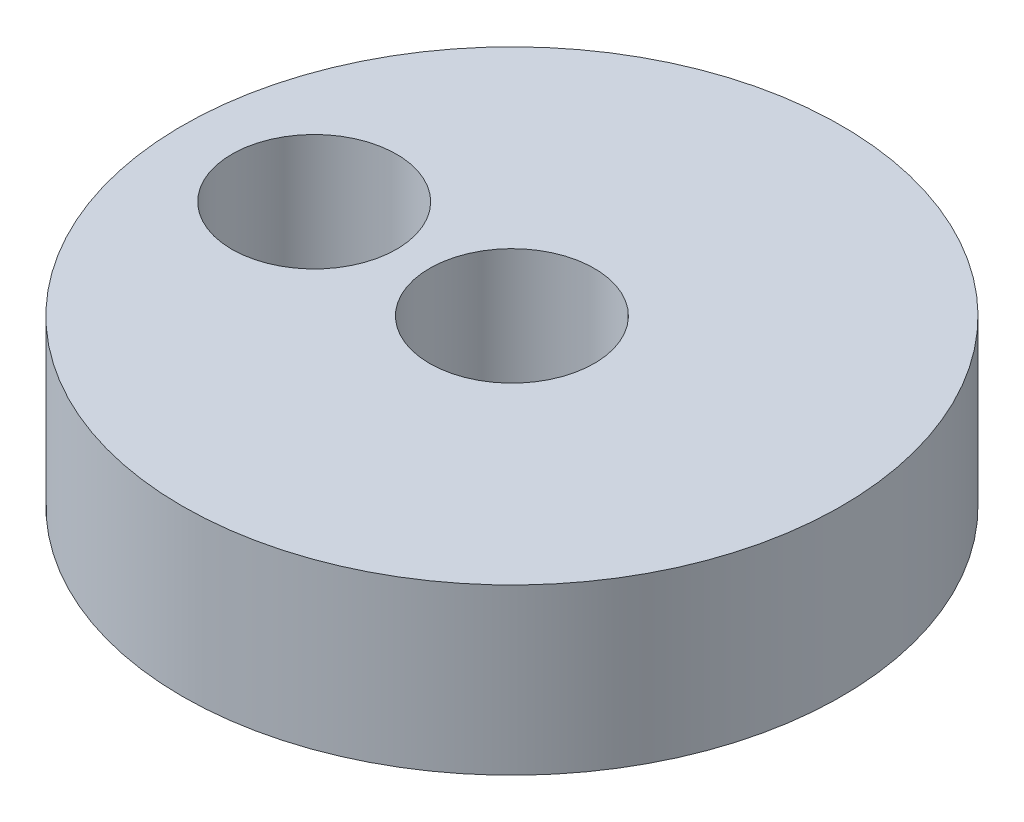
ISO-10303-21;
HEADER;
FILE_DESCRIPTION(('STEP AP214'),'2;1');
FILE_NAME('part.step','',(''),(''),'','','');
FILE_SCHEMA(('AUTOMOTIVE_DESIGN { 1 0 10303 214 1 1 1 1 }'));
ENDSEC;
DATA;
#1=APPLICATION_CONTEXT('core data for automotive mechanical design processes');
#2=APPLICATION_PROTOCOL_DEFINITION('international standard','automotive_design',2000,#1);
#3=PRODUCT_CONTEXT('',#1,'mechanical');
#4=PRODUCT('Part','Part','',(#3));
#5=PRODUCT_RELATED_PRODUCT_CATEGORY('part','',(#4));
#6=PRODUCT_DEFINITION_FORMATION('','',#4);
#7=PRODUCT_DEFINITION_CONTEXT('part definition',#1,'design');
#8=PRODUCT_DEFINITION('design','',#6,#7);
#9=PRODUCT_DEFINITION_SHAPE('','',#8);
#10=(LENGTH_UNIT() NAMED_UNIT(*) SI_UNIT(.MILLI.,.METRE.));
#11=(NAMED_UNIT(*) PLANE_ANGLE_UNIT() SI_UNIT($,.RADIAN.));
#12=(NAMED_UNIT(*) SI_UNIT($,.STERADIAN.) SOLID_ANGLE_UNIT());
#13=UNCERTAINTY_MEASURE_WITH_UNIT(LENGTH_MEASURE(1.E-05),#10,'distance_accuracy_value','');
#14=(GEOMETRIC_REPRESENTATION_CONTEXT(3) GLOBAL_UNCERTAINTY_ASSIGNED_CONTEXT((#13)) GLOBAL_UNIT_ASSIGNED_CONTEXT((#10,
#11,#12)) REPRESENTATION_CONTEXT('',''));
#15=CARTESIAN_POINT('',(0.,0.,0.));
#16=DIRECTION('',(0.,0.,1.));
#17=DIRECTION('',(1.,0.,0.));
#18=AXIS2_PLACEMENT_3D('',#15,#16,#17);
#19=CARTESIAN_POINT('',(0.,10.,0.));
#20=DIRECTION('',(0.,1.,0.));
#21=DIRECTION('',(0.,0.,1.));
#22=AXIS2_PLACEMENT_3D('',#19,#20,#21);
#23=PLANE('',#22);
#24=CARTESIAN_POINT('',(-12.,10.,0.));
#25=DIRECTION('',(0.,1.,0.));
#26=DIRECTION('',(0.,0.,1.));
#27=AXIS2_PLACEMENT_3D('',#24,#25,#26);
#28=CIRCLE('',#27,5.);
#29=CARTESIAN_POINT('',(-12.,10.,5.));
#30=VERTEX_POINT('',#29);
#31=EDGE_CURVE('E52',#30,#30,#28,.T.);
#32=ORIENTED_EDGE('',*,*,#31,.F.);
#33=EDGE_LOOP('',(#32));
#34=FACE_BOUND('',#33,.T.);
#35=CARTESIAN_POINT('',(0.,10.,0.));
#36=DIRECTION('',(0.,1.,0.));
#37=DIRECTION('',(0.,0.,1.));
#38=AXIS2_PLACEMENT_3D('',#35,#36,#37);
#39=CIRCLE('',#38,20.);
#40=CARTESIAN_POINT('',(0.,10.,20.));
#41=VERTEX_POINT('',#40);
#42=EDGE_CURVE('E10',#41,#41,#39,.T.);
#43=ORIENTED_EDGE('',*,*,#42,.T.);
#44=EDGE_LOOP('',(#43));
#45=FACE_BOUND('',#44,.T.);
#46=CARTESIAN_POINT('',(0.,10.,0.));
#47=DIRECTION('',(0.,1.,0.));
#48=DIRECTION('',(0.,0.,1.));
#49=AXIS2_PLACEMENT_3D('',#46,#47,#48);
#50=CIRCLE('',#49,5.);
#51=CARTESIAN_POINT('',(0.,10.,5.));
#52=VERTEX_POINT('',#51);
#53=EDGE_CURVE('E44',#52,#52,#50,.T.);
#54=ORIENTED_EDGE('',*,*,#53,.F.);
#55=EDGE_LOOP('',(#54));
#56=FACE_BOUND('',#55,.T.);
#57=ADVANCED_FACE('F33',(#34,#45,#56),#23,.T.);
#58=CARTESIAN_POINT('',(0.,0.,0.));
#59=DIRECTION('',(0.,1.,0.));
#60=DIRECTION('',(0.,0.,1.));
#61=AXIS2_PLACEMENT_3D('',#58,#59,#60);
#62=PLANE('',#61);
#63=CARTESIAN_POINT('',(-12.,0.,0.));
#64=DIRECTION('',(0.,1.,0.));
#65=DIRECTION('',(0.,0.,1.));
#66=AXIS2_PLACEMENT_3D('',#63,#64,#65);
#67=CIRCLE('',#66,5.);
#68=CARTESIAN_POINT('',(-12.,0.,5.));
#69=VERTEX_POINT('',#68);
#70=EDGE_CURVE('E49',#69,#69,#67,.T.);
#71=ORIENTED_EDGE('',*,*,#70,.T.);
#72=EDGE_LOOP('',(#71));
#73=FACE_BOUND('',#72,.T.);
#74=CARTESIAN_POINT('',(0.,0.,0.));
#75=DIRECTION('',(0.,1.,0.));
#76=DIRECTION('',(0.,0.,1.));
#77=AXIS2_PLACEMENT_3D('',#74,#75,#76);
#78=CIRCLE('',#77,20.);
#79=CARTESIAN_POINT('',(0.,0.,20.));
#80=VERTEX_POINT('',#79);
#81=EDGE_CURVE('E37',#80,#80,#78,.T.);
#82=ORIENTED_EDGE('',*,*,#81,.F.);
#83=EDGE_LOOP('',(#82));
#84=FACE_BOUND('',#83,.T.);
#85=CARTESIAN_POINT('',(0.,0.,0.));
#86=DIRECTION('',(0.,1.,0.));
#87=DIRECTION('',(0.,0.,1.));
#88=AXIS2_PLACEMENT_3D('',#85,#86,#87);
#89=CIRCLE('',#88,5.);
#90=CARTESIAN_POINT('',(0.,0.,5.));
#91=VERTEX_POINT('',#90);
#92=EDGE_CURVE('E46',#91,#91,#89,.T.);
#93=ORIENTED_EDGE('',*,*,#92,.T.);
#94=EDGE_LOOP('',(#93));
#95=FACE_BOUND('',#94,.T.);
#96=ADVANCED_FACE('F58',(#73,#84,#95),#62,.F.);
#97=CARTESIAN_POINT('',(0.,10.,0.));
#98=DIRECTION('',(0.,-1.,0.));
#99=DIRECTION('',(0.,0.,-1.));
#100=AXIS2_PLACEMENT_3D('',#97,#98,#99);
#101=CYLINDRICAL_SURFACE('',#100,20.);
#102=ORIENTED_EDGE('',*,*,#42,.F.);
#103=EDGE_LOOP('',(#102));
#104=FACE_BOUND('',#103,.T.);
#105=ORIENTED_EDGE('',*,*,#81,.T.);
#106=EDGE_LOOP('',(#105));
#107=FACE_BOUND('',#106,.T.);
#108=ADVANCED_FACE('F35',(#104,#107),#101,.T.);
#109=CARTESIAN_POINT('',(0.,10.,0.));
#110=DIRECTION('',(0.,-1.,0.));
#111=DIRECTION('',(0.,0.,-1.));
#112=AXIS2_PLACEMENT_3D('',#109,#110,#111);
#113=CYLINDRICAL_SURFACE('',#112,5.);
#114=ORIENTED_EDGE('',*,*,#53,.T.);
#115=EDGE_LOOP('',(#114));
#116=FACE_BOUND('',#115,.T.);
#117=ORIENTED_EDGE('',*,*,#92,.F.);
#118=EDGE_LOOP('',(#117));
#119=FACE_BOUND('',#118,.T.);
#120=ADVANCED_FACE('F64',(#116,#119),#113,.F.);
#121=CARTESIAN_POINT('',(-12.,0.,0.));
#122=DIRECTION('',(0.,1.,0.));
#123=DIRECTION('',(0.,0.,1.));
#124=AXIS2_PLACEMENT_3D('',#121,#122,#123);
#125=CYLINDRICAL_SURFACE('',#124,5.);
#126=ORIENTED_EDGE('',*,*,#70,.F.);
#127=EDGE_LOOP('',(#126));
#128=FACE_BOUND('',#127,.T.);
#129=ORIENTED_EDGE('',*,*,#31,.T.);
#130=EDGE_LOOP('',(#129));
#131=FACE_BOUND('',#130,.T.);
#132=ADVANCED_FACE('F61',(#128,#131),#125,.F.);
#133=CLOSED_SHELL('',(#57,#96,#108,#120,#132));
#134=MANIFOLD_SOLID_BREP('B2',#133);
#135=ADVANCED_BREP_SHAPE_REPRESENTATION('',(#18,#134),#14);
#136=SHAPE_DEFINITION_REPRESENTATION(#9,#135);
ENDSEC;
END-ISO-10303-21;
